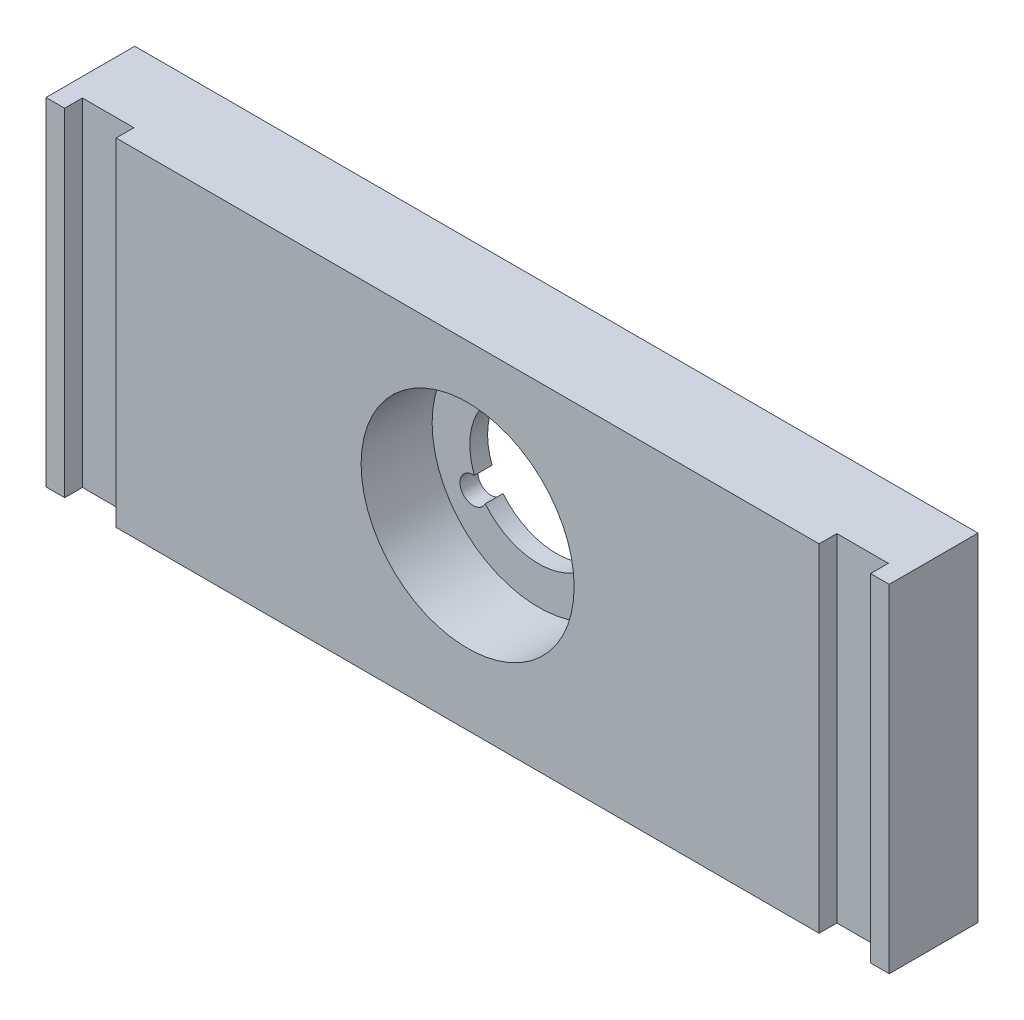
ISO-10303-21;
HEADER;
FILE_DESCRIPTION(('STEP AP214'),'2;1');
FILE_NAME('part.step','',(''),(''),'','','');
FILE_SCHEMA(('AUTOMOTIVE_DESIGN { 1 0 10303 214 1 1 1 1 }'));
ENDSEC;
DATA;
#1=APPLICATION_CONTEXT('core data for automotive mechanical design processes');
#2=APPLICATION_PROTOCOL_DEFINITION('international standard','automotive_design',2000,#1);
#3=PRODUCT_CONTEXT('',#1,'mechanical');
#4=PRODUCT('Part','Part','',(#3));
#5=PRODUCT_RELATED_PRODUCT_CATEGORY('part','',(#4));
#6=PRODUCT_DEFINITION_FORMATION('','',#4);
#7=PRODUCT_DEFINITION_CONTEXT('part definition',#1,'design');
#8=PRODUCT_DEFINITION('design','',#6,#7);
#9=PRODUCT_DEFINITION_SHAPE('','',#8);
#10=(LENGTH_UNIT() NAMED_UNIT(*) SI_UNIT(.MILLI.,.METRE.));
#11=(NAMED_UNIT(*) PLANE_ANGLE_UNIT() SI_UNIT($,.RADIAN.));
#12=(NAMED_UNIT(*) SI_UNIT($,.STERADIAN.) SOLID_ANGLE_UNIT());
#13=UNCERTAINTY_MEASURE_WITH_UNIT(LENGTH_MEASURE(1.E-05),#10,'distance_accuracy_value','');
#14=(GEOMETRIC_REPRESENTATION_CONTEXT(3) GLOBAL_UNCERTAINTY_ASSIGNED_CONTEXT((#13)) GLOBAL_UNIT_ASSIGNED_CONTEXT((#10,
#11,#12)) REPRESENTATION_CONTEXT('',''));
#15=CARTESIAN_POINT('',(0.,0.,0.));
#16=DIRECTION('',(0.,0.,1.));
#17=DIRECTION('',(1.,0.,0.));
#18=AXIS2_PLACEMENT_3D('',#15,#16,#17);
#19=CARTESIAN_POINT('',(3.,-2.,10.));
#20=DIRECTION('',(0.,0.,-1.));
#21=DIRECTION('',(-1.,0.,0.));
#22=AXIS2_PLACEMENT_3D('',#19,#20,#21);
#23=PLANE('',#22);
#24=CARTESIAN_POINT('',(50.5,-20.,10.));
#25=DIRECTION('',(0.,0.,1.));
#26=DIRECTION('',(1.,0.,0.));
#27=AXIS2_PLACEMENT_3D('',#24,#25,#26);
#28=CIRCLE('',#27,12.);
#29=CARTESIAN_POINT('',(62.5,-20.,10.));
#30=VERTEX_POINT('',#29);
#31=EDGE_CURVE('E206',#30,#30,#28,.T.);
#32=ORIENTED_EDGE('',*,*,#31,.F.);
#33=EDGE_LOOP('',(#32));
#34=FACE_BOUND('',#33,.T.);
#35=DIRECTION('',(1.,0.,0.));
#36=VECTOR('',#35,1.);
#37=CARTESIAN_POINT('',(98.,-40.,10.));
#38=LINE('',#37,#36);
#39=CARTESIAN_POINT('',(10.9,-40.,10.));
#40=VERTEX_POINT('',#39);
#41=CARTESIAN_POINT('',(90.1,-40.,10.));
#42=VERTEX_POINT('',#41);
#43=EDGE_CURVE('E273',#40,#42,#38,.T.);
#44=ORIENTED_EDGE('',*,*,#43,.T.);
#45=DIRECTION('',(0.,-1.,0.));
#46=VECTOR('',#45,1.);
#47=CARTESIAN_POINT('',(90.1,-40.,10.));
#48=LINE('',#47,#46);
#49=CARTESIAN_POINT('',(90.1,-2.,10.));
#50=VERTEX_POINT('',#49);
#51=EDGE_CURVE('E160',#50,#42,#48,.T.);
#52=ORIENTED_EDGE('',*,*,#51,.F.);
#53=DIRECTION('',(-1.,0.,0.));
#54=VECTOR('',#53,1.);
#55=CARTESIAN_POINT('',(3.,-2.,10.));
#56=LINE('',#55,#54);
#57=CARTESIAN_POINT('',(10.9,-2.,10.));
#58=VERTEX_POINT('',#57);
#59=EDGE_CURVE('E280',#50,#58,#56,.T.);
#60=ORIENTED_EDGE('',*,*,#59,.T.);
#61=DIRECTION('',(0.,1.,0.));
#62=VECTOR('',#61,1.);
#63=CARTESIAN_POINT('',(10.9,-40.,10.));
#64=LINE('',#63,#62);
#65=EDGE_CURVE('E185',#40,#58,#64,.T.);
#66=ORIENTED_EDGE('',*,*,#65,.F.);
#67=EDGE_LOOP('',(#44,#52,#60,#66));
#68=FACE_BOUND('',#67,.T.);
#69=ADVANCED_FACE('F30',(#34,#68),#23,.F.);
#70=CARTESIAN_POINT('',(3.,-40.,10.));
#71=VERTEX_POINT('',#70);
#72=CARTESIAN_POINT('',(5.1,-40.,10.));
#73=VERTEX_POINT('',#72);
#74=EDGE_CURVE('E269',#71,#73,#38,.T.);
#75=ORIENTED_EDGE('',*,*,#74,.T.);
#76=DIRECTION('',(0.,-1.,0.));
#77=VECTOR('',#76,1.);
#78=CARTESIAN_POINT('',(5.1,-40.,10.));
#79=LINE('',#78,#77);
#80=CARTESIAN_POINT('',(5.1,-2.,10.));
#81=VERTEX_POINT('',#80);
#82=EDGE_CURVE('E192',#81,#73,#79,.T.);
#83=ORIENTED_EDGE('',*,*,#82,.F.);
#84=CARTESIAN_POINT('',(3.,-2.,10.));
#85=VERTEX_POINT('',#84);
#86=EDGE_CURVE('E275',#81,#85,#56,.T.);
#87=ORIENTED_EDGE('',*,*,#86,.T.);
#88=DIRECTION('',(0.,-1.,0.));
#89=VECTOR('',#88,1.);
#90=CARTESIAN_POINT('',(3.,-40.,10.));
#91=LINE('',#90,#89);
#92=EDGE_CURVE('E264',#85,#71,#91,.T.);
#93=ORIENTED_EDGE('',*,*,#92,.T.);
#94=EDGE_LOOP('',(#75,#83,#87,#93));
#95=FACE_BOUND('',#94,.T.);
#96=ADVANCED_FACE('F333',(#95),#23,.F.);
#97=CARTESIAN_POINT('',(50.5,-20.,10.));
#98=DIRECTION('',(0.,0.,-1.));
#99=DIRECTION('',(-1.,0.,0.));
#100=AXIS2_PLACEMENT_3D('',#97,#98,#99);
#101=CYLINDRICAL_SURFACE('',#100,7.75);
#102=DIRECTION('',(0.,0.,-1.));
#103=VECTOR('',#102,1.);
#104=CARTESIAN_POINT('',(57.7439441639614,-22.754591249062,10.));
#105=LINE('',#104,#103);
#106=CARTESIAN_POINT('',(57.7439441639614,-22.754591249062,2.));
#107=VERTEX_POINT('',#106);
#108=CARTESIAN_POINT('',(57.7439441639614,-22.754591249062,0.));
#109=VERTEX_POINT('',#108);
#110=EDGE_CURVE('E251',#107,#109,#105,.T.);
#111=ORIENTED_EDGE('',*,*,#110,.F.);
#112=CARTESIAN_POINT('',(50.5,-20.,2.));
#113=DIRECTION('',(0.,0.,1.));
#114=DIRECTION('',(1.,0.,0.));
#115=AXIS2_PLACEMENT_3D('',#112,#113,#114);
#116=CIRCLE('',#115,7.75);
#117=CARTESIAN_POINT('',(51.7364260832507,-12.3492647058823,2.));
#118=VERTEX_POINT('',#117);
#119=EDGE_CURVE('E230',#107,#118,#116,.T.);
#120=ORIENTED_EDGE('',*,*,#119,.T.);
#121=DIRECTION('',(0.,0.,-1.));
#122=VECTOR('',#121,1.);
#123=CARTESIAN_POINT('',(51.7364260832507,-12.3492647058823,10.));
#124=LINE('',#123,#122);
#125=CARTESIAN_POINT('',(51.7364260832507,-12.3492647058823,0.));
#126=VERTEX_POINT('',#125);
#127=EDGE_CURVE('E261',#118,#126,#124,.T.);
#128=ORIENTED_EDGE('',*,*,#127,.T.);
#129=CARTESIAN_POINT('',(50.5,-20.,0.));
#130=DIRECTION('',(0.,0.,1.));
#131=DIRECTION('',(1.,0.,0.));
#132=AXIS2_PLACEMENT_3D('',#129,#130,#131);
#133=CIRCLE('',#132,7.75);
#134=EDGE_CURVE('E233',#109,#126,#133,.T.);
#135=ORIENTED_EDGE('',*,*,#134,.F.);
#136=EDGE_LOOP('',(#111,#120,#128,#135));
#137=FACE_BOUND('',#136,.T.);
#138=ADVANCED_FACE('F335',(#137),#101,.F.);
#139=CARTESIAN_POINT('',(50.5,-11.5,10.));
#140=DIRECTION('',(0.,0.,-1.));
#141=DIRECTION('',(-1.,0.,0.));
#142=AXIS2_PLACEMENT_3D('',#139,#140,#141);
#143=CYLINDRICAL_SURFACE('',#142,1.5);
#144=ORIENTED_EDGE('',*,*,#127,.F.);
#145=CARTESIAN_POINT('',(50.5,-11.5,2.));
#146=DIRECTION('',(0.,0.,1.));
#147=DIRECTION('',(1.,0.,0.));
#148=AXIS2_PLACEMENT_3D('',#145,#146,#147);
#149=CIRCLE('',#148,1.5);
#150=CARTESIAN_POINT('',(49.2635739167494,-12.3492647058823,2.));
#151=VERTEX_POINT('',#150);
#152=EDGE_CURVE('E227',#118,#151,#149,.T.);
#153=ORIENTED_EDGE('',*,*,#152,.T.);
#154=DIRECTION('',(0.,0.,-1.));
#155=VECTOR('',#154,1.);
#156=CARTESIAN_POINT('',(49.2635739167494,-12.3492647058823,10.));
#157=LINE('',#156,#155);
#158=CARTESIAN_POINT('',(49.2635739167494,-12.3492647058823,0.));
#159=VERTEX_POINT('',#158);
#160=EDGE_CURVE('E259',#151,#159,#157,.T.);
#161=ORIENTED_EDGE('',*,*,#160,.T.);
#162=CARTESIAN_POINT('',(50.5,-11.5,0.));
#163=DIRECTION('',(0.,0.,1.));
#164=DIRECTION('',(1.,0.,0.));
#165=AXIS2_PLACEMENT_3D('',#162,#163,#164);
#166=CIRCLE('',#165,1.5);
#167=EDGE_CURVE('E236',#126,#159,#166,.T.);
#168=ORIENTED_EDGE('',*,*,#167,.F.);
#169=EDGE_LOOP('',(#144,#153,#161,#168));
#170=FACE_BOUND('',#169,.T.);
#171=ADVANCED_FACE('F341',(#170),#143,.F.);
#172=CARTESIAN_POINT('',(50.5,-20.,10.));
#173=DIRECTION('',(0.,0.,-1.));
#174=DIRECTION('',(-1.,0.,0.));
#175=AXIS2_PLACEMENT_3D('',#172,#173,#174);
#176=CYLINDRICAL_SURFACE('',#175,7.75);
#177=ORIENTED_EDGE('',*,*,#160,.F.);
#178=CARTESIAN_POINT('',(50.5,-20.,2.));
#179=DIRECTION('',(0.,0.,1.));
#180=DIRECTION('',(1.,0.,0.));
#181=AXIS2_PLACEMENT_3D('',#178,#179,#180);
#182=CIRCLE('',#181,7.75);
#183=CARTESIAN_POINT('',(43.2560558360386,-22.754591249062,2.));
#184=VERTEX_POINT('',#183);
#185=EDGE_CURVE('E224',#151,#184,#182,.T.);
#186=ORIENTED_EDGE('',*,*,#185,.T.);
#187=DIRECTION('',(0.,0.,-1.));
#188=VECTOR('',#187,1.);
#189=CARTESIAN_POINT('',(43.2560558360386,-22.754591249062,10.));
#190=LINE('',#189,#188);
#191=CARTESIAN_POINT('',(43.2560558360386,-22.754591249062,0.));
#192=VERTEX_POINT('',#191);
#193=EDGE_CURVE('E257',#184,#192,#190,.T.);
#194=ORIENTED_EDGE('',*,*,#193,.T.);
#195=CARTESIAN_POINT('',(50.5,-20.,0.));
#196=DIRECTION('',(0.,0.,1.));
#197=DIRECTION('',(1.,0.,0.));
#198=AXIS2_PLACEMENT_3D('',#195,#196,#197);
#199=CIRCLE('',#198,7.75);
#200=EDGE_CURVE('E239',#159,#192,#199,.T.);
#201=ORIENTED_EDGE('',*,*,#200,.F.);
#202=EDGE_LOOP('',(#177,#186,#194,#201));
#203=FACE_BOUND('',#202,.T.);
#204=ADVANCED_FACE('F368',(#203),#176,.F.);
#205=CARTESIAN_POINT('',(43.1387840678324,-24.25,10.));
#206=DIRECTION('',(0.,0.,-1.));
#207=DIRECTION('',(-1.,0.,0.));
#208=AXIS2_PLACEMENT_3D('',#205,#206,#207);
#209=CYLINDRICAL_SURFACE('',#208,1.50000000000001);
#210=ORIENTED_EDGE('',*,*,#193,.F.);
#211=CARTESIAN_POINT('',(43.1387840678324,-24.25,2.));
#212=DIRECTION('',(0.,0.,1.));
#213=DIRECTION('',(1.,0.,0.));
#214=AXIS2_PLACEMENT_3D('',#211,#212,#213);
#215=CIRCLE('',#214,1.50000000000001);
#216=CARTESIAN_POINT('',(44.4924819192894,-24.8961440450557,2.));
#217=VERTEX_POINT('',#216);
#218=EDGE_CURVE('E221',#184,#217,#215,.T.);
#219=ORIENTED_EDGE('',*,*,#218,.T.);
#220=DIRECTION('',(0.,0.,-1.));
#221=VECTOR('',#220,1.);
#222=CARTESIAN_POINT('',(44.4924819192894,-24.8961440450557,10.));
#223=LINE('',#222,#221);
#224=CARTESIAN_POINT('',(44.4924819192894,-24.8961440450557,0.));
#225=VERTEX_POINT('',#224);
#226=EDGE_CURVE('E255',#217,#225,#223,.T.);
#227=ORIENTED_EDGE('',*,*,#226,.T.);
#228=CARTESIAN_POINT('',(43.1387840678324,-24.25,0.));
#229=DIRECTION('',(0.,0.,1.));
#230=DIRECTION('',(1.,0.,0.));
#231=AXIS2_PLACEMENT_3D('',#228,#229,#230);
#232=CIRCLE('',#231,1.50000000000001);
#233=EDGE_CURVE('E242',#192,#225,#232,.T.);
#234=ORIENTED_EDGE('',*,*,#233,.F.);
#235=EDGE_LOOP('',(#210,#219,#227,#234));
#236=FACE_BOUND('',#235,.T.);
#237=ADVANCED_FACE('F358',(#236),#209,.F.);
#238=CARTESIAN_POINT('',(50.5,-20.,10.));
#239=DIRECTION('',(0.,0.,-1.));
#240=DIRECTION('',(-1.,0.,0.));
#241=AXIS2_PLACEMENT_3D('',#238,#239,#240);
#242=CYLINDRICAL_SURFACE('',#241,7.75);
#243=ORIENTED_EDGE('',*,*,#226,.F.);
#244=CARTESIAN_POINT('',(50.5,-20.,2.));
#245=DIRECTION('',(0.,0.,1.));
#246=DIRECTION('',(1.,0.,0.));
#247=AXIS2_PLACEMENT_3D('',#244,#245,#246);
#248=CIRCLE('',#247,7.75);
#249=CARTESIAN_POINT('',(56.5075180807109,-24.8961440450554,2.));
#250=VERTEX_POINT('',#249);
#251=EDGE_CURVE('E216',#217,#250,#248,.T.);
#252=ORIENTED_EDGE('',*,*,#251,.T.);
#253=DIRECTION('',(0.,0.,-1.));
#254=VECTOR('',#253,1.);
#255=CARTESIAN_POINT('',(56.5075180807109,-24.8961440450554,10.));
#256=LINE('',#255,#254);
#257=CARTESIAN_POINT('',(56.5075180807109,-24.8961440450554,0.));
#258=VERTEX_POINT('',#257);
#259=EDGE_CURVE('E253',#250,#258,#256,.T.);
#260=ORIENTED_EDGE('',*,*,#259,.T.);
#261=CARTESIAN_POINT('',(50.5,-20.,0.));
#262=DIRECTION('',(0.,0.,1.));
#263=DIRECTION('',(1.,0.,0.));
#264=AXIS2_PLACEMENT_3D('',#261,#262,#263);
#265=CIRCLE('',#264,7.75);
#266=EDGE_CURVE('E245',#225,#258,#265,.T.);
#267=ORIENTED_EDGE('',*,*,#266,.F.);
#268=EDGE_LOOP('',(#243,#252,#260,#267));
#269=FACE_BOUND('',#268,.T.);
#270=ADVANCED_FACE('F352',(#269),#242,.F.);
#271=CARTESIAN_POINT('',(57.8612159321679,-24.2499999999999,10.));
#272=DIRECTION('',(0.,0.,-1.));
#273=DIRECTION('',(-1.,0.,0.));
#274=AXIS2_PLACEMENT_3D('',#271,#272,#273);
#275=CYLINDRICAL_SURFACE('',#274,1.5);
#276=ORIENTED_EDGE('',*,*,#259,.F.);
#277=CARTESIAN_POINT('',(57.8612159321679,-24.2499999999999,2.));
#278=DIRECTION('',(0.,0.,1.));
#279=DIRECTION('',(1.,0.,0.));
#280=AXIS2_PLACEMENT_3D('',#277,#278,#279);
#281=CIRCLE('',#280,1.5);
#282=EDGE_CURVE('E11',#250,#107,#281,.T.);
#283=ORIENTED_EDGE('',*,*,#282,.T.);
#284=ORIENTED_EDGE('',*,*,#110,.T.);
#285=CARTESIAN_POINT('',(57.8612159321679,-24.2499999999999,0.));
#286=DIRECTION('',(0.,0.,1.));
#287=DIRECTION('',(1.,0.,0.));
#288=AXIS2_PLACEMENT_3D('',#285,#286,#287);
#289=CIRCLE('',#288,1.5);
#290=EDGE_CURVE('E248',#258,#109,#289,.T.);
#291=ORIENTED_EDGE('',*,*,#290,.F.);
#292=EDGE_LOOP('',(#276,#283,#284,#291));
#293=FACE_BOUND('',#292,.T.);
#294=ADVANCED_FACE('F347',(#293),#275,.F.);
#295=CARTESIAN_POINT('',(98.,-2.,10.));
#296=VERTEX_POINT('',#295);
#297=CARTESIAN_POINT('',(95.9,-2.,10.));
#298=VERTEX_POINT('',#297);
#299=EDGE_CURVE('E276',#296,#298,#56,.T.);
#300=ORIENTED_EDGE('',*,*,#299,.T.);
#301=DIRECTION('',(0.,1.,0.));
#302=VECTOR('',#301,1.);
#303=CARTESIAN_POINT('',(95.9,-40.,10.));
#304=LINE('',#303,#302);
#305=CARTESIAN_POINT('',(95.9,-40.,10.));
#306=VERTEX_POINT('',#305);
#307=EDGE_CURVE('E173',#306,#298,#304,.T.);
#308=ORIENTED_EDGE('',*,*,#307,.F.);
#309=CARTESIAN_POINT('',(98.,-40.,10.));
#310=VERTEX_POINT('',#309);
#311=EDGE_CURVE('E267',#306,#310,#38,.T.);
#312=ORIENTED_EDGE('',*,*,#311,.T.);
#313=DIRECTION('',(0.,1.,0.));
#314=VECTOR('',#313,1.);
#315=CARTESIAN_POINT('',(98.,-2.,10.));
#316=LINE('',#315,#314);
#317=EDGE_CURVE('E272',#310,#296,#316,.T.);
#318=ORIENTED_EDGE('',*,*,#317,.T.);
#319=EDGE_LOOP('',(#300,#308,#312,#318));
#320=FACE_BOUND('',#319,.T.);
#321=ADVANCED_FACE('F317',(#320),#23,.F.);
#322=CARTESIAN_POINT('',(3.,-2.,0.));
#323=DIRECTION('',(0.,0.,-1.));
#324=DIRECTION('',(-1.,0.,0.));
#325=AXIS2_PLACEMENT_3D('',#322,#323,#324);
#326=PLANE('',#325);
#327=DIRECTION('',(0.,-1.,0.));
#328=VECTOR('',#327,1.);
#329=CARTESIAN_POINT('',(3.,-40.,0.));
#330=LINE('',#329,#328);
#331=CARTESIAN_POINT('',(3.,-2.,0.));
#332=VERTEX_POINT('',#331);
#333=CARTESIAN_POINT('',(3.,-40.,0.));
#334=VERTEX_POINT('',#333);
#335=EDGE_CURVE('E263',#332,#334,#330,.T.);
#336=ORIENTED_EDGE('',*,*,#335,.F.);
#337=DIRECTION('',(-1.,0.,0.));
#338=VECTOR('',#337,1.);
#339=CARTESIAN_POINT('',(3.,-2.,0.));
#340=LINE('',#339,#338);
#341=CARTESIAN_POINT('',(98.,-2.,0.));
#342=VERTEX_POINT('',#341);
#343=EDGE_CURVE('E268',#342,#332,#340,.T.);
#344=ORIENTED_EDGE('',*,*,#343,.F.);
#345=DIRECTION('',(0.,1.,0.));
#346=VECTOR('',#345,1.);
#347=CARTESIAN_POINT('',(98.,-2.,0.));
#348=LINE('',#347,#346);
#349=CARTESIAN_POINT('',(98.,-40.,0.));
#350=VERTEX_POINT('',#349);
#351=EDGE_CURVE('E285',#350,#342,#348,.T.);
#352=ORIENTED_EDGE('',*,*,#351,.F.);
#353=DIRECTION('',(1.,0.,0.));
#354=VECTOR('',#353,1.);
#355=CARTESIAN_POINT('',(98.,-40.,0.));
#356=LINE('',#355,#354);
#357=EDGE_CURVE('E283',#334,#350,#356,.T.);
#358=ORIENTED_EDGE('',*,*,#357,.F.);
#359=EDGE_LOOP('',(#336,#344,#352,#358));
#360=FACE_BOUND('',#359,.T.);
#361=ORIENTED_EDGE('',*,*,#290,.T.);
#362=ORIENTED_EDGE('',*,*,#134,.T.);
#363=ORIENTED_EDGE('',*,*,#167,.T.);
#364=ORIENTED_EDGE('',*,*,#200,.T.);
#365=ORIENTED_EDGE('',*,*,#233,.T.);
#366=ORIENTED_EDGE('',*,*,#266,.T.);
#367=EDGE_LOOP('',(#361,#362,#363,#364,#365,#366));
#368=FACE_BOUND('',#367,.T.);
#369=ADVANCED_FACE('F304',(#360,#368),#326,.T.);
#370=CARTESIAN_POINT('',(3.,-40.,10.));
#371=DIRECTION('',(1.,0.,0.));
#372=DIRECTION('',(0.,0.,-1.));
#373=AXIS2_PLACEMENT_3D('',#370,#371,#372);
#374=PLANE('',#373);
#375=ORIENTED_EDGE('',*,*,#335,.T.);
#376=DIRECTION('',(0.,0.,-1.));
#377=VECTOR('',#376,1.);
#378=CARTESIAN_POINT('',(3.,-40.,10.));
#379=LINE('',#378,#377);
#380=EDGE_CURVE('E38',#71,#334,#379,.T.);
#381=ORIENTED_EDGE('',*,*,#380,.F.);
#382=ORIENTED_EDGE('',*,*,#92,.F.);
#383=DIRECTION('',(0.,0.,-1.));
#384=VECTOR('',#383,1.);
#385=CARTESIAN_POINT('',(3.,-2.,10.));
#386=LINE('',#385,#384);
#387=EDGE_CURVE('E279',#85,#332,#386,.T.);
#388=ORIENTED_EDGE('',*,*,#387,.T.);
#389=EDGE_LOOP('',(#375,#381,#382,#388));
#390=FACE_BOUND('',#389,.T.);
#391=ADVANCED_FACE('F32',(#390),#374,.F.);
#392=CARTESIAN_POINT('',(98.,-40.,10.));
#393=DIRECTION('',(0.,1.,0.));
#394=DIRECTION('',(-1.,0.,0.));
#395=AXIS2_PLACEMENT_3D('',#392,#393,#394);
#396=PLANE('',#395);
#397=DIRECTION('',(1.,0.,0.));
#398=VECTOR('',#397,1.);
#399=CARTESIAN_POINT('',(90.1,-40.,8.));
#400=LINE('',#399,#398);
#401=CARTESIAN_POINT('',(90.1,-40.,8.));
#402=VERTEX_POINT('',#401);
#403=CARTESIAN_POINT('',(95.9,-40.,8.));
#404=VERTEX_POINT('',#403);
#405=EDGE_CURVE('E169',#402,#404,#400,.T.);
#406=ORIENTED_EDGE('',*,*,#405,.F.);
#407=DIRECTION('',(0.,0.,1.));
#408=VECTOR('',#407,1.);
#409=CARTESIAN_POINT('',(90.1,-40.,8.));
#410=LINE('',#409,#408);
#411=EDGE_CURVE('E155',#402,#42,#410,.T.);
#412=ORIENTED_EDGE('',*,*,#411,.T.);
#413=ORIENTED_EDGE('',*,*,#43,.F.);
#414=DIRECTION('',(0.,0.,1.));
#415=VECTOR('',#414,1.);
#416=CARTESIAN_POINT('',(10.9,-40.,8.));
#417=LINE('',#416,#415);
#418=CARTESIAN_POINT('',(10.9,-40.,8.));
#419=VERTEX_POINT('',#418);
#420=EDGE_CURVE('E199',#419,#40,#417,.T.);
#421=ORIENTED_EDGE('',*,*,#420,.F.);
#422=DIRECTION('',(1.,0.,0.));
#423=VECTOR('',#422,1.);
#424=CARTESIAN_POINT('',(10.9,-40.,8.));
#425=LINE('',#424,#423);
#426=CARTESIAN_POINT('',(5.1,-40.,8.));
#427=VERTEX_POINT('',#426);
#428=EDGE_CURVE('E190',#427,#419,#425,.T.);
#429=ORIENTED_EDGE('',*,*,#428,.F.);
#430=DIRECTION('',(0.,0.,1.));
#431=VECTOR('',#430,1.);
#432=CARTESIAN_POINT('',(5.1,-40.,8.));
#433=LINE('',#432,#431);
#434=EDGE_CURVE('E203',#427,#73,#433,.T.);
#435=ORIENTED_EDGE('',*,*,#434,.T.);
#436=ORIENTED_EDGE('',*,*,#74,.F.);
#437=ORIENTED_EDGE('',*,*,#380,.T.);
#438=ORIENTED_EDGE('',*,*,#357,.T.);
#439=DIRECTION('',(0.,0.,-1.));
#440=VECTOR('',#439,1.);
#441=CARTESIAN_POINT('',(98.,-40.,10.));
#442=LINE('',#441,#440);
#443=EDGE_CURVE('E293',#310,#350,#442,.T.);
#444=ORIENTED_EDGE('',*,*,#443,.F.);
#445=ORIENTED_EDGE('',*,*,#311,.F.);
#446=DIRECTION('',(0.,0.,1.));
#447=VECTOR('',#446,1.);
#448=CARTESIAN_POINT('',(95.9,-40.,8.));
#449=LINE('',#448,#447);
#450=EDGE_CURVE('E165',#404,#306,#449,.T.);
#451=ORIENTED_EDGE('',*,*,#450,.F.);
#452=EDGE_LOOP('',(#406,#412,#413,#421,#429,#435,#436,#437,#438,#444,#445,#451));
#453=FACE_BOUND('',#452,.T.);
#454=ADVANCED_FACE('F175',(#453),#396,.F.);
#455=CARTESIAN_POINT('',(98.,-2.,10.));
#456=DIRECTION('',(-1.,0.,0.));
#457=DIRECTION('',(0.,0.,1.));
#458=AXIS2_PLACEMENT_3D('',#455,#456,#457);
#459=PLANE('',#458);
#460=ORIENTED_EDGE('',*,*,#351,.T.);
#461=DIRECTION('',(0.,0.,-1.));
#462=VECTOR('',#461,1.);
#463=CARTESIAN_POINT('',(98.,-2.,10.));
#464=LINE('',#463,#462);
#465=EDGE_CURVE('E290',#296,#342,#464,.T.);
#466=ORIENTED_EDGE('',*,*,#465,.F.);
#467=ORIENTED_EDGE('',*,*,#317,.F.);
#468=ORIENTED_EDGE('',*,*,#443,.T.);
#469=EDGE_LOOP('',(#460,#466,#467,#468));
#470=FACE_BOUND('',#469,.T.);
#471=ADVANCED_FACE('F309',(#470),#459,.F.);
#472=CARTESIAN_POINT('',(3.,-2.,10.));
#473=DIRECTION('',(0.,-1.,0.));
#474=DIRECTION('',(0.,0.,-1.));
#475=AXIS2_PLACEMENT_3D('',#472,#473,#474);
#476=PLANE('',#475);
#477=ORIENTED_EDGE('',*,*,#59,.F.);
#478=DIRECTION('',(0.,0.,1.));
#479=VECTOR('',#478,1.);
#480=CARTESIAN_POINT('',(90.1,-2.,8.));
#481=LINE('',#480,#479);
#482=CARTESIAN_POINT('',(90.1,-2.,8.));
#483=VERTEX_POINT('',#482);
#484=EDGE_CURVE('E183',#483,#50,#481,.T.);
#485=ORIENTED_EDGE('',*,*,#484,.F.);
#486=DIRECTION('',(-1.,0.,0.));
#487=VECTOR('',#486,1.);
#488=CARTESIAN_POINT('',(95.9,-2.,8.));
#489=LINE('',#488,#487);
#490=CARTESIAN_POINT('',(95.9,-2.,8.));
#491=VERTEX_POINT('',#490);
#492=EDGE_CURVE('E166',#491,#483,#489,.T.);
#493=ORIENTED_EDGE('',*,*,#492,.F.);
#494=DIRECTION('',(0.,0.,1.));
#495=VECTOR('',#494,1.);
#496=CARTESIAN_POINT('',(95.9,-2.,8.));
#497=LINE('',#496,#495);
#498=EDGE_CURVE('E186',#491,#298,#497,.T.);
#499=ORIENTED_EDGE('',*,*,#498,.T.);
#500=ORIENTED_EDGE('',*,*,#299,.F.);
#501=ORIENTED_EDGE('',*,*,#465,.T.);
#502=ORIENTED_EDGE('',*,*,#343,.T.);
#503=ORIENTED_EDGE('',*,*,#387,.F.);
#504=ORIENTED_EDGE('',*,*,#86,.F.);
#505=DIRECTION('',(0.,0.,1.));
#506=VECTOR('',#505,1.);
#507=CARTESIAN_POINT('',(5.1,-2.,8.));
#508=LINE('',#507,#506);
#509=CARTESIAN_POINT('',(5.1,-2.,8.));
#510=VERTEX_POINT('',#509);
#511=EDGE_CURVE('E207',#510,#81,#508,.T.);
#512=ORIENTED_EDGE('',*,*,#511,.F.);
#513=DIRECTION('',(-1.,0.,0.));
#514=VECTOR('',#513,1.);
#515=CARTESIAN_POINT('',(5.1,-2.,8.));
#516=LINE('',#515,#514);
#517=CARTESIAN_POINT('',(10.9,-2.,8.));
#518=VERTEX_POINT('',#517);
#519=EDGE_CURVE('E194',#518,#510,#516,.T.);
#520=ORIENTED_EDGE('',*,*,#519,.F.);
#521=DIRECTION('',(0.,0.,1.));
#522=VECTOR('',#521,1.);
#523=CARTESIAN_POINT('',(10.9,-2.,8.));
#524=LINE('',#523,#522);
#525=EDGE_CURVE('E209',#518,#58,#524,.T.);
#526=ORIENTED_EDGE('',*,*,#525,.T.);
#527=EDGE_LOOP('',(#477,#485,#493,#499,#500,#501,#502,#503,#504,#512,#520,#526));
#528=FACE_BOUND('',#527,.T.);
#529=ADVANCED_FACE('F314',(#528),#476,.F.);
#530=CARTESIAN_POINT('',(50.5,-20.,2.));
#531=DIRECTION('',(0.,0.,1.));
#532=DIRECTION('',(1.,0.,0.));
#533=AXIS2_PLACEMENT_3D('',#530,#531,#532);
#534=CYLINDRICAL_SURFACE('',#533,12.);
#535=CARTESIAN_POINT('',(50.5,-20.,2.));
#536=DIRECTION('',(0.,0.,1.));
#537=DIRECTION('',(1.,0.,0.));
#538=AXIS2_PLACEMENT_3D('',#535,#536,#537);
#539=CIRCLE('',#538,12.);
#540=CARTESIAN_POINT('',(62.5,-20.,2.));
#541=VERTEX_POINT('',#540);
#542=EDGE_CURVE('E213',#541,#541,#539,.T.);
#543=ORIENTED_EDGE('',*,*,#542,.F.);
#544=EDGE_LOOP('',(#543));
#545=FACE_BOUND('',#544,.T.);
#546=ORIENTED_EDGE('',*,*,#31,.T.);
#547=EDGE_LOOP('',(#546));
#548=FACE_BOUND('',#547,.T.);
#549=ADVANCED_FACE('F363',(#545,#548),#534,.F.);
#550=CARTESIAN_POINT('',(50.5,-20.,2.));
#551=DIRECTION('',(0.,0.,1.));
#552=DIRECTION('',(1.,0.,0.));
#553=AXIS2_PLACEMENT_3D('',#550,#551,#552);
#554=PLANE('',#553);
#555=ORIENTED_EDGE('',*,*,#282,.F.);
#556=ORIENTED_EDGE('',*,*,#251,.F.);
#557=ORIENTED_EDGE('',*,*,#218,.F.);
#558=ORIENTED_EDGE('',*,*,#185,.F.);
#559=ORIENTED_EDGE('',*,*,#152,.F.);
#560=ORIENTED_EDGE('',*,*,#119,.F.);
#561=EDGE_LOOP('',(#555,#556,#557,#558,#559,#560));
#562=FACE_BOUND('',#561,.T.);
#563=ORIENTED_EDGE('',*,*,#542,.T.);
#564=EDGE_LOOP('',(#563));
#565=FACE_BOUND('',#564,.T.);
#566=ADVANCED_FACE('F383',(#562,#565),#554,.T.);
#567=CARTESIAN_POINT('',(5.1,-40.,8.));
#568=DIRECTION('',(-1.,0.,0.));
#569=DIRECTION('',(0.,-1.,0.));
#570=AXIS2_PLACEMENT_3D('',#567,#568,#569);
#571=PLANE('',#570);
#572=ORIENTED_EDGE('',*,*,#82,.T.);
#573=ORIENTED_EDGE('',*,*,#434,.F.);
#574=DIRECTION('',(0.,-1.,0.));
#575=VECTOR('',#574,1.);
#576=CARTESIAN_POINT('',(5.1,-40.,8.));
#577=LINE('',#576,#575);
#578=EDGE_CURVE('E196',#510,#427,#577,.T.);
#579=ORIENTED_EDGE('',*,*,#578,.F.);
#580=ORIENTED_EDGE('',*,*,#511,.T.);
#581=EDGE_LOOP('',(#572,#573,#579,#580));
#582=FACE_BOUND('',#581,.T.);
#583=ADVANCED_FACE('F329',(#582),#571,.F.);
#584=CARTESIAN_POINT('',(10.9,-40.,8.));
#585=DIRECTION('',(1.,0.,0.));
#586=DIRECTION('',(0.,1.,0.));
#587=AXIS2_PLACEMENT_3D('',#584,#585,#586);
#588=PLANE('',#587);
#589=ORIENTED_EDGE('',*,*,#65,.T.);
#590=ORIENTED_EDGE('',*,*,#525,.F.);
#591=DIRECTION('',(0.,1.,0.));
#592=VECTOR('',#591,1.);
#593=CARTESIAN_POINT('',(10.9,-40.,8.));
#594=LINE('',#593,#592);
#595=EDGE_CURVE('E53',#419,#518,#594,.T.);
#596=ORIENTED_EDGE('',*,*,#595,.F.);
#597=ORIENTED_EDGE('',*,*,#420,.T.);
#598=EDGE_LOOP('',(#589,#590,#596,#597));
#599=FACE_BOUND('',#598,.T.);
#600=ADVANCED_FACE('F323',(#599),#588,.F.);
#601=CARTESIAN_POINT('',(5.1,-40.,8.));
#602=DIRECTION('',(0.,0.,-1.));
#603=DIRECTION('',(-1.,0.,0.));
#604=AXIS2_PLACEMENT_3D('',#601,#602,#603);
#605=PLANE('',#604);
#606=ORIENTED_EDGE('',*,*,#428,.T.);
#607=ORIENTED_EDGE('',*,*,#595,.T.);
#608=ORIENTED_EDGE('',*,*,#519,.T.);
#609=ORIENTED_EDGE('',*,*,#578,.T.);
#610=EDGE_LOOP('',(#606,#607,#608,#609));
#611=FACE_BOUND('',#610,.T.);
#612=ADVANCED_FACE('F325',(#611),#605,.F.);
#613=CARTESIAN_POINT('',(90.1,-40.,8.));
#614=DIRECTION('',(-1.,0.,0.));
#615=DIRECTION('',(0.,-1.,0.));
#616=AXIS2_PLACEMENT_3D('',#613,#614,#615);
#617=PLANE('',#616);
#618=ORIENTED_EDGE('',*,*,#51,.T.);
#619=ORIENTED_EDGE('',*,*,#411,.F.);
#620=DIRECTION('',(0.,-1.,0.));
#621=VECTOR('',#620,1.);
#622=CARTESIAN_POINT('',(90.1,-40.,8.));
#623=LINE('',#622,#621);
#624=EDGE_CURVE('E158',#483,#402,#623,.T.);
#625=ORIENTED_EDGE('',*,*,#624,.F.);
#626=ORIENTED_EDGE('',*,*,#484,.T.);
#627=EDGE_LOOP('',(#618,#619,#625,#626));
#628=FACE_BOUND('',#627,.T.);
#629=ADVANCED_FACE('F157',(#628),#617,.F.);
#630=CARTESIAN_POINT('',(95.9,-40.,8.));
#631=DIRECTION('',(1.,0.,0.));
#632=DIRECTION('',(0.,1.,0.));
#633=AXIS2_PLACEMENT_3D('',#630,#631,#632);
#634=PLANE('',#633);
#635=ORIENTED_EDGE('',*,*,#307,.T.);
#636=ORIENTED_EDGE('',*,*,#498,.F.);
#637=DIRECTION('',(0.,1.,0.));
#638=VECTOR('',#637,1.);
#639=CARTESIAN_POINT('',(95.9,-40.,8.));
#640=LINE('',#639,#638);
#641=EDGE_CURVE('E45',#404,#491,#640,.T.);
#642=ORIENTED_EDGE('',*,*,#641,.F.);
#643=ORIENTED_EDGE('',*,*,#450,.T.);
#644=EDGE_LOOP('',(#635,#636,#642,#643));
#645=FACE_BOUND('',#644,.T.);
#646=ADVANCED_FACE('F510',(#645),#634,.F.);
#647=CARTESIAN_POINT('',(90.1,-2.,8.));
#648=DIRECTION('',(0.,0.,1.));
#649=DIRECTION('',(1.,0.,0.));
#650=AXIS2_PLACEMENT_3D('',#647,#648,#649);
#651=PLANE('',#650);
#652=ORIENTED_EDGE('',*,*,#624,.T.);
#653=ORIENTED_EDGE('',*,*,#405,.T.);
#654=ORIENTED_EDGE('',*,*,#641,.T.);
#655=ORIENTED_EDGE('',*,*,#492,.T.);
#656=EDGE_LOOP('',(#652,#653,#654,#655));
#657=FACE_BOUND('',#656,.T.);
#658=ADVANCED_FACE('F168',(#657),#651,.T.);
#659=CLOSED_SHELL('',(#69,#96,#138,#171,#204,#237,#270,#294,#321,#369,#391,#454,#471,#529,#549,
#566,#583,#600,#612,#629,#646,#658));
#660=MANIFOLD_SOLID_BREP('B2',#659);
#661=ADVANCED_BREP_SHAPE_REPRESENTATION('',(#18,#660),#14);
#662=SHAPE_DEFINITION_REPRESENTATION(#9,#661);
ENDSEC;
END-ISO-10303-21;
